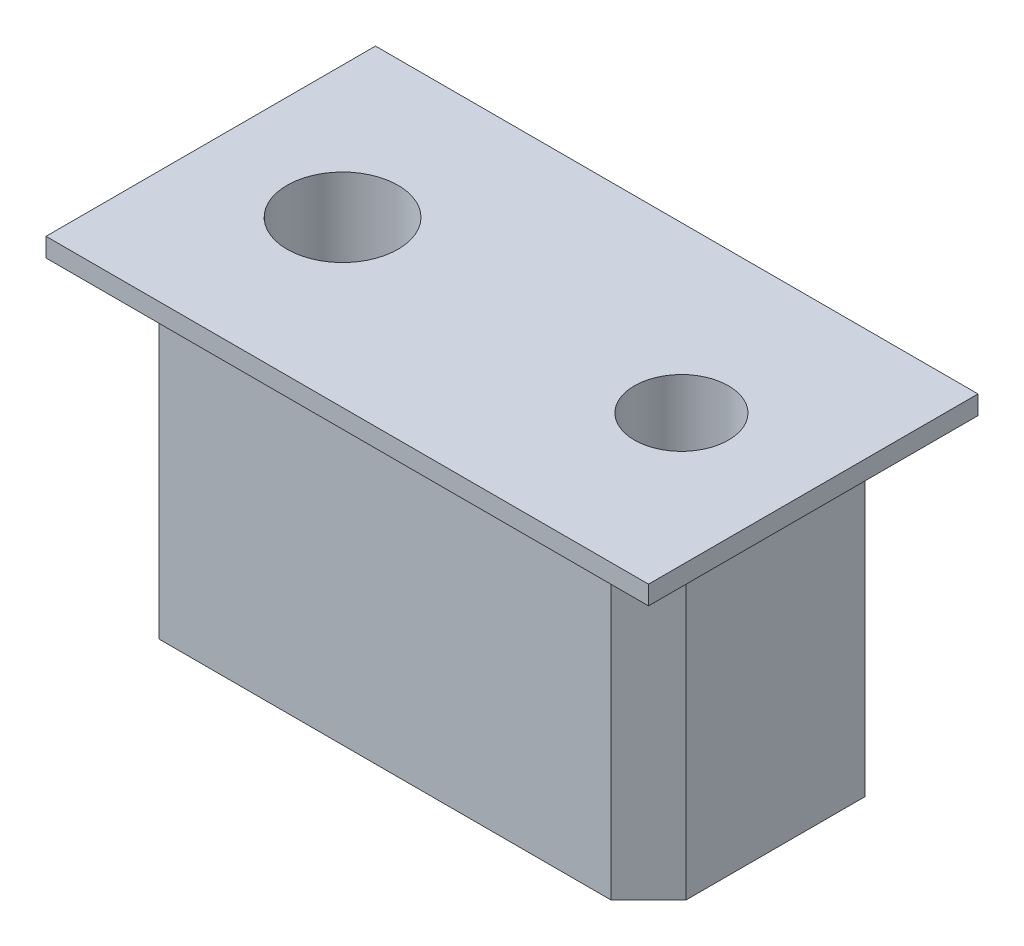
ISO-10303-21;
HEADER;
FILE_DESCRIPTION(('STEP AP214'),'2;1');
FILE_NAME('part.step','',(''),(''),'','','');
FILE_SCHEMA(('AUTOMOTIVE_DESIGN { 1 0 10303 214 1 1 1 1 }'));
ENDSEC;
DATA;
#1=APPLICATION_CONTEXT('core data for automotive mechanical design processes');
#2=APPLICATION_PROTOCOL_DEFINITION('international standard','automotive_design',2000,#1);
#3=PRODUCT_CONTEXT('',#1,'mechanical');
#4=PRODUCT('Part','Part','',(#3));
#5=PRODUCT_RELATED_PRODUCT_CATEGORY('part','',(#4));
#6=PRODUCT_DEFINITION_FORMATION('','',#4);
#7=PRODUCT_DEFINITION_CONTEXT('part definition',#1,'design');
#8=PRODUCT_DEFINITION('design','',#6,#7);
#9=PRODUCT_DEFINITION_SHAPE('','',#8);
#10=(LENGTH_UNIT() NAMED_UNIT(*) SI_UNIT(.MILLI.,.METRE.));
#11=(NAMED_UNIT(*) PLANE_ANGLE_UNIT() SI_UNIT($,.RADIAN.));
#12=(NAMED_UNIT(*) SI_UNIT($,.STERADIAN.) SOLID_ANGLE_UNIT());
#13=UNCERTAINTY_MEASURE_WITH_UNIT(LENGTH_MEASURE(1.E-05),#10,'distance_accuracy_value','');
#14=(GEOMETRIC_REPRESENTATION_CONTEXT(3) GLOBAL_UNCERTAINTY_ASSIGNED_CONTEXT((#13)) GLOBAL_UNIT_ASSIGNED_CONTEXT((#10,
#11,#12)) REPRESENTATION_CONTEXT('',''));
#15=CARTESIAN_POINT('',(0.,0.,0.));
#16=DIRECTION('',(0.,0.,1.));
#17=DIRECTION('',(1.,0.,0.));
#18=AXIS2_PLACEMENT_3D('',#15,#16,#17);
#19=CARTESIAN_POINT('',(-6.99999999999998,185.000000000001,3.37500000000002));
#20=DIRECTION('',(0.,1.,0.));
#21=DIRECTION('',(0.,0.,0.999999999999998));
#22=AXIS2_PLACEMENT_3D('',#19,#20,#21);
#23=PLANE('',#22);
#24=DIRECTION('',(0.,0.,-0.999999999999998));
#25=VECTOR('',#24,1.);
#26=CARTESIAN_POINT('',(-6.99999999999998,185.000000000001,3.37500000000002));
#27=LINE('',#26,#25);
#28=CARTESIAN_POINT('',(-6.99999999999998,185.000000000001,2.37500000000002));
#29=VERTEX_POINT('',#28);
#30=CARTESIAN_POINT('',(-6.99999999999998,185.000000000001,-2.37500000000002));
#31=VERTEX_POINT('',#30);
#32=EDGE_CURVE('E212',#29,#31,#27,.T.);
#33=ORIENTED_EDGE('',*,*,#32,.T.);
#34=DIRECTION('',(-0.707106781186548,0.,0.707106781186545));
#35=VECTOR('',#34,1.);
#36=CARTESIAN_POINT('',(-6.99999999999998,185.000000000001,-2.37500000000002));
#37=LINE('',#36,#35);
#38=CARTESIAN_POINT('',(-5.99999999999998,185.,-3.37500000000002));
#39=VERTEX_POINT('',#38);
#40=EDGE_CURVE('E233',#31,#39,#37,.F.);
#41=ORIENTED_EDGE('',*,*,#40,.T.);
#42=DIRECTION('',(1.,0.,0.));
#43=VECTOR('',#42,1.);
#44=CARTESIAN_POINT('',(-6.99999999999998,185.000000000001,-3.37500000000002));
#45=LINE('',#44,#43);
#46=CARTESIAN_POINT('',(6.00000000000002,185.,-3.37500000000002));
#47=VERTEX_POINT('',#46);
#48=EDGE_CURVE('E198',#39,#47,#45,.T.);
#49=ORIENTED_EDGE('',*,*,#48,.T.);
#50=DIRECTION('',(-0.707106781186548,0.,-0.707106781186546));
#51=VECTOR('',#50,1.);
#52=CARTESIAN_POINT('',(7.00000000000002,185.000000000001,-2.37500000000002));
#53=LINE('',#52,#51);
#54=CARTESIAN_POINT('',(7.00000000000002,185.000000000001,-2.37500000000002));
#55=VERTEX_POINT('',#54);
#56=EDGE_CURVE('E231',#47,#55,#53,.F.);
#57=ORIENTED_EDGE('',*,*,#56,.T.);
#58=DIRECTION('',(0.,0.,-0.999999999999998));
#59=VECTOR('',#58,1.);
#60=CARTESIAN_POINT('',(7.00000000000004,185.000000000001,3.37500000000002));
#61=LINE('',#60,#59);
#62=CARTESIAN_POINT('',(7.00000000000004,185.000000000001,2.37500000000002));
#63=VERTEX_POINT('',#62);
#64=EDGE_CURVE('E208',#63,#55,#61,.T.);
#65=ORIENTED_EDGE('',*,*,#64,.F.);
#66=DIRECTION('',(-0.707106781186546,0.,0.707106781186547));
#67=VECTOR('',#66,1.);
#68=CARTESIAN_POINT('',(6.00000000000002,185.,3.37500000000002));
#69=LINE('',#68,#67);
#70=CARTESIAN_POINT('',(6.00000000000002,185.,3.37500000000002));
#71=VERTEX_POINT('',#70);
#72=EDGE_CURVE('E229',#63,#71,#69,.T.);
#73=ORIENTED_EDGE('',*,*,#72,.T.);
#74=DIRECTION('',(1.,0.,0.));
#75=VECTOR('',#74,1.);
#76=CARTESIAN_POINT('',(-6.99999999999998,185.000000000001,3.37500000000002));
#77=LINE('',#76,#75);
#78=CARTESIAN_POINT('',(-5.99999999999998,185.,3.37500000000002));
#79=VERTEX_POINT('',#78);
#80=EDGE_CURVE('E201',#79,#71,#77,.T.);
#81=ORIENTED_EDGE('',*,*,#80,.F.);
#82=DIRECTION('',(-0.707106781186547,0.,-0.707106781186546));
#83=VECTOR('',#82,1.);
#84=CARTESIAN_POINT('',(-5.99999999999998,185.,3.37500000000002));
#85=LINE('',#84,#83);
#86=EDGE_CURVE('E227',#79,#29,#85,.T.);
#87=ORIENTED_EDGE('',*,*,#86,.T.);
#88=EDGE_LOOP('',(#33,#41,#49,#57,#65,#73,#81,#87));
#89=FACE_BOUND('',#88,.T.);
#90=CARTESIAN_POINT('',(-4.49999999999999,185.,0.));
#91=DIRECTION('',(0.,1.,0.));
#92=DIRECTION('',(0.,0.,0.999999999999998));
#93=AXIS2_PLACEMENT_3D('',#90,#91,#92);
#94=CIRCLE('',#93,1.4732);
#95=CARTESIAN_POINT('',(-4.49999999999999,185.,1.4732));
#96=VERTEX_POINT('',#95);
#97=EDGE_CURVE('E219',#96,#96,#94,.T.);
#98=ORIENTED_EDGE('',*,*,#97,.T.);
#99=EDGE_LOOP('',(#98));
#100=FACE_BOUND('',#99,.T.);
#101=CARTESIAN_POINT('',(4.50000000000002,185.,0.));
#102=DIRECTION('',(0.,1.,0.));
#103=DIRECTION('',(0.,0.,0.999999999999998));
#104=AXIS2_PLACEMENT_3D('',#101,#102,#103);
#105=CIRCLE('',#104,1.25);
#106=CARTESIAN_POINT('',(4.50000000000002,185.,1.25));
#107=VERTEX_POINT('',#106);
#108=EDGE_CURVE('E220',#107,#107,#105,.F.);
#109=ORIENTED_EDGE('',*,*,#108,.F.);
#110=EDGE_LOOP('',(#109));
#111=FACE_BOUND('',#110,.T.);
#112=ADVANCED_FACE('F56',(#89,#100,#111),#23,.F.);
#113=CARTESIAN_POINT('',(8.00000000000002,193.7625,-4.37500000000002));
#114=DIRECTION('',(0.,1.,0.));
#115=DIRECTION('',(0.,0.,0.999999999999998));
#116=AXIS2_PLACEMENT_3D('',#113,#114,#115);
#117=PLANE('',#116);
#118=DIRECTION('',(0.,0.,-0.999999999999998));
#119=VECTOR('',#118,1.);
#120=CARTESIAN_POINT('',(8.00000000000002,193.7625,4.37500000000002));
#121=LINE('',#120,#119);
#122=CARTESIAN_POINT('',(8.00000000000002,193.7625,4.37500000000002));
#123=VERTEX_POINT('',#122);
#124=CARTESIAN_POINT('',(8.00000000000002,193.7625,-4.37500000000002));
#125=VERTEX_POINT('',#124);
#126=EDGE_CURVE('E183',#123,#125,#121,.T.);
#127=ORIENTED_EDGE('',*,*,#126,.T.);
#128=DIRECTION('',(-1.,0.,0.));
#129=VECTOR('',#128,1.);
#130=CARTESIAN_POINT('',(8.00000000000002,193.7625,-4.37500000000002));
#131=LINE('',#130,#129);
#132=CARTESIAN_POINT('',(-8.00000000000001,193.7625,-4.37500000000002));
#133=VERTEX_POINT('',#132);
#134=EDGE_CURVE('E172',#125,#133,#131,.T.);
#135=ORIENTED_EDGE('',*,*,#134,.T.);
#136=DIRECTION('',(0.,0.,0.999999999999998));
#137=VECTOR('',#136,1.);
#138=CARTESIAN_POINT('',(-8.00000000000001,193.7625,-4.37500000000002));
#139=LINE('',#138,#137);
#140=CARTESIAN_POINT('',(-8.00000000000002,193.7625,4.37500000000002));
#141=VERTEX_POINT('',#140);
#142=EDGE_CURVE('E182',#133,#141,#139,.T.);
#143=ORIENTED_EDGE('',*,*,#142,.T.);
#144=DIRECTION('',(1.,0.,0.));
#145=VECTOR('',#144,1.);
#146=CARTESIAN_POINT('',(-8.00000000000002,193.7625,4.37500000000002));
#147=LINE('',#146,#145);
#148=EDGE_CURVE('E189',#141,#123,#147,.T.);
#149=ORIENTED_EDGE('',*,*,#148,.T.);
#150=EDGE_LOOP('',(#127,#135,#143,#149));
#151=FACE_BOUND('',#150,.T.);
#152=CARTESIAN_POINT('',(-4.49999999999999,193.7625,0.));
#153=DIRECTION('',(0.,1.,0.));
#154=DIRECTION('',(0.,0.,0.999999999999998));
#155=AXIS2_PLACEMENT_3D('',#152,#153,#154);
#156=CIRCLE('',#155,1.4732);
#157=CARTESIAN_POINT('',(-4.49999999999999,193.7625,1.4732));
#158=VERTEX_POINT('',#157);
#159=EDGE_CURVE('E216',#158,#158,#156,.T.);
#160=ORIENTED_EDGE('',*,*,#159,.F.);
#161=EDGE_LOOP('',(#160));
#162=FACE_BOUND('',#161,.T.);
#163=CARTESIAN_POINT('',(4.50000000000001,193.762500000001,0.));
#164=DIRECTION('',(0.,1.,0.));
#165=DIRECTION('',(0.,0.,0.999999999999998));
#166=AXIS2_PLACEMENT_3D('',#163,#164,#165);
#167=CIRCLE('',#166,1.25);
#168=CARTESIAN_POINT('',(4.50000000000001,193.762500000001,1.25));
#169=VERTEX_POINT('',#168);
#170=EDGE_CURVE('E221',#169,#169,#167,.F.);
#171=ORIENTED_EDGE('',*,*,#170,.T.);
#172=EDGE_LOOP('',(#171));
#173=FACE_BOUND('',#172,.T.);
#174=ADVANCED_FACE('F186',(#151,#162,#173),#117,.T.);
#175=CARTESIAN_POINT('',(-7.,193.2625,3.37500000000002));
#176=DIRECTION('',(1.,0.,0.));
#177=DIRECTION('',(0.,1.,0.));
#178=AXIS2_PLACEMENT_3D('',#175,#176,#177);
#179=PLANE('',#178);
#180=DIRECTION('',(0.,1.,0.));
#181=VECTOR('',#180,1.);
#182=CARTESIAN_POINT('',(-7.,193.2625,2.37500000000002));
#183=LINE('',#182,#181);
#184=CARTESIAN_POINT('',(-7.00000000000001,193.0125,2.37500000000002));
#185=VERTEX_POINT('',#184);
#186=EDGE_CURVE('E215',#29,#185,#183,.T.);
#187=ORIENTED_EDGE('',*,*,#186,.T.);
#188=DIRECTION('',(0.,0.,-0.999999999999998));
#189=VECTOR('',#188,1.);
#190=CARTESIAN_POINT('',(-6.99999999999999,193.012500000001,-2.37500000000002));
#191=LINE('',#190,#189);
#192=CARTESIAN_POINT('',(-6.99999999999999,193.012500000001,-2.37500000000002));
#193=VERTEX_POINT('',#192);
#194=EDGE_CURVE('E73',#185,#193,#191,.T.);
#195=ORIENTED_EDGE('',*,*,#194,.T.);
#196=DIRECTION('',(0.,-1.,0.));
#197=VECTOR('',#196,1.);
#198=CARTESIAN_POINT('',(-7.,193.2625,-2.37500000000002));
#199=LINE('',#198,#197);
#200=EDGE_CURVE('E225',#193,#31,#199,.T.);
#201=ORIENTED_EDGE('',*,*,#200,.T.);
#202=ORIENTED_EDGE('',*,*,#32,.F.);
#203=EDGE_LOOP('',(#187,#195,#201,#202));
#204=FACE_BOUND('',#203,.T.);
#205=ADVANCED_FACE('F314',(#204),#179,.F.);
#206=CARTESIAN_POINT('',(7.00000000000001,193.262500000001,3.37500000000002));
#207=DIRECTION('',(-1.,0.,0.));
#208=DIRECTION('',(0.,-1.,0.));
#209=AXIS2_PLACEMENT_3D('',#206,#207,#208);
#210=PLANE('',#209);
#211=DIRECTION('',(0.,1.,0.));
#212=VECTOR('',#211,1.);
#213=CARTESIAN_POINT('',(7.00000000000001,193.262500000001,-2.37500000000002));
#214=LINE('',#213,#212);
#215=CARTESIAN_POINT('',(7.00000000000002,193.012500000001,-2.37500000000002));
#216=VERTEX_POINT('',#215);
#217=EDGE_CURVE('E241',#55,#216,#214,.T.);
#218=ORIENTED_EDGE('',*,*,#217,.T.);
#219=DIRECTION('',(0.,0.,-0.999999999999998));
#220=VECTOR('',#219,1.);
#221=CARTESIAN_POINT('',(7.00000000000001,193.0125,2.37500000000002));
#222=LINE('',#221,#220);
#223=CARTESIAN_POINT('',(7.00000000000001,193.0125,2.37500000000002));
#224=VERTEX_POINT('',#223);
#225=EDGE_CURVE('E65',#216,#224,#222,.F.);
#226=ORIENTED_EDGE('',*,*,#225,.T.);
#227=DIRECTION('',(0.,-1.,0.));
#228=VECTOR('',#227,1.);
#229=CARTESIAN_POINT('',(7.00000000000004,185.000000000001,2.37500000000002));
#230=LINE('',#229,#228);
#231=EDGE_CURVE('E239',#224,#63,#230,.T.);
#232=ORIENTED_EDGE('',*,*,#231,.T.);
#233=ORIENTED_EDGE('',*,*,#64,.T.);
#234=EDGE_LOOP('',(#218,#226,#232,#233));
#235=FACE_BOUND('',#234,.T.);
#236=ADVANCED_FACE('F378',(#235),#210,.F.);
#237=CARTESIAN_POINT('',(-6.99999999999998,185.000000000001,3.37500000000002));
#238=DIRECTION('',(0.,0.,0.999999999999998));
#239=DIRECTION('',(1.,0.,0.));
#240=AXIS2_PLACEMENT_3D('',#237,#238,#239);
#241=PLANE('',#240);
#242=DIRECTION('',(0.,1.,0.));
#243=VECTOR('',#242,1.);
#244=CARTESIAN_POINT('',(6.00000000000002,193.2625,3.37500000000002));
#245=LINE('',#244,#243);
#246=CARTESIAN_POINT('',(6.,193.0125,3.37500000000002));
#247=VERTEX_POINT('',#246);
#248=EDGE_CURVE('E246',#71,#247,#245,.T.);
#249=ORIENTED_EDGE('',*,*,#248,.T.);
#250=DIRECTION('',(-1.,0.,0.));
#251=VECTOR('',#250,1.);
#252=CARTESIAN_POINT('',(-7.00000000000001,193.0125,3.37500000000002));
#253=LINE('',#252,#251);
#254=CARTESIAN_POINT('',(-6.,193.0125,3.37500000000002));
#255=VERTEX_POINT('',#254);
#256=EDGE_CURVE('E12',#247,#255,#253,.T.);
#257=ORIENTED_EDGE('',*,*,#256,.T.);
#258=DIRECTION('',(0.,-1.,0.));
#259=VECTOR('',#258,1.);
#260=CARTESIAN_POINT('',(-5.99999999999998,185.,3.37500000000002));
#261=LINE('',#260,#259);
#262=EDGE_CURVE('E244',#255,#79,#261,.T.);
#263=ORIENTED_EDGE('',*,*,#262,.T.);
#264=ORIENTED_EDGE('',*,*,#80,.T.);
#265=EDGE_LOOP('',(#249,#257,#263,#264));
#266=FACE_BOUND('',#265,.T.);
#267=ADVANCED_FACE('F324',(#266),#241,.T.);
#268=CARTESIAN_POINT('',(-6.99999999999998,185.000000000001,-3.37500000000002));
#269=DIRECTION('',(0.,0.,0.999999999999998));
#270=DIRECTION('',(1.,0.,0.));
#271=AXIS2_PLACEMENT_3D('',#268,#269,#270);
#272=PLANE('',#271);
#273=DIRECTION('',(0.,1.,0.));
#274=VECTOR('',#273,1.);
#275=CARTESIAN_POINT('',(-5.99999999999998,185.,-3.37500000000002));
#276=LINE('',#275,#274);
#277=CARTESIAN_POINT('',(-6.,193.0125,-3.37500000000002));
#278=VERTEX_POINT('',#277);
#279=EDGE_CURVE('E237',#39,#278,#276,.T.);
#280=ORIENTED_EDGE('',*,*,#279,.T.);
#281=DIRECTION('',(-1.,0.,0.));
#282=VECTOR('',#281,1.);
#283=CARTESIAN_POINT('',(6.00000000000001,193.0125,-3.37500000000002));
#284=LINE('',#283,#282);
#285=CARTESIAN_POINT('',(6.00000000000001,193.0125,-3.37500000000002));
#286=VERTEX_POINT('',#285);
#287=EDGE_CURVE('E274',#278,#286,#284,.F.);
#288=ORIENTED_EDGE('',*,*,#287,.T.);
#289=DIRECTION('',(0.,-1.,0.));
#290=VECTOR('',#289,1.);
#291=CARTESIAN_POINT('',(6.00000000000002,185.,-3.37500000000002));
#292=LINE('',#291,#290);
#293=EDGE_CURVE('E235',#286,#47,#292,.T.);
#294=ORIENTED_EDGE('',*,*,#293,.T.);
#295=ORIENTED_EDGE('',*,*,#48,.F.);
#296=EDGE_LOOP('',(#280,#288,#294,#295));
#297=FACE_BOUND('',#296,.T.);
#298=ADVANCED_FACE('F355',(#297),#272,.F.);
#299=CARTESIAN_POINT('',(8.00000000000002,193.7625,4.37500000000002));
#300=DIRECTION('',(-1.,0.,0.));
#301=DIRECTION('',(0.,0.,0.999999999999998));
#302=AXIS2_PLACEMENT_3D('',#299,#300,#301);
#303=PLANE('',#302);
#304=DIRECTION('',(0.,0.,-0.999999999999998));
#305=VECTOR('',#304,1.);
#306=CARTESIAN_POINT('',(8.00000000000001,193.2625,4.37500000000002));
#307=LINE('',#306,#305);
#308=CARTESIAN_POINT('',(8.00000000000001,193.2625,4.37500000000002));
#309=VERTEX_POINT('',#308);
#310=CARTESIAN_POINT('',(8.00000000000002,193.2625,-4.37500000000002));
#311=VERTEX_POINT('',#310);
#312=EDGE_CURVE('E197',#309,#311,#307,.T.);
#313=ORIENTED_EDGE('',*,*,#312,.T.);
#314=DIRECTION('',(0.,-1.,0.));
#315=VECTOR('',#314,1.);
#316=CARTESIAN_POINT('',(8.00000000000002,193.7625,-4.37500000000002));
#317=LINE('',#316,#315);
#318=EDGE_CURVE('E176',#125,#311,#317,.T.);
#319=ORIENTED_EDGE('',*,*,#318,.F.);
#320=ORIENTED_EDGE('',*,*,#126,.F.);
#321=DIRECTION('',(0.,-1.,0.));
#322=VECTOR('',#321,1.);
#323=CARTESIAN_POINT('',(8.00000000000002,193.7625,4.37500000000002));
#324=LINE('',#323,#322);
#325=EDGE_CURVE('E577',#123,#309,#324,.T.);
#326=ORIENTED_EDGE('',*,*,#325,.T.);
#327=EDGE_LOOP('',(#313,#319,#320,#326));
#328=FACE_BOUND('',#327,.T.);
#329=ADVANCED_FACE('F195',(#328),#303,.F.);
#330=CARTESIAN_POINT('',(8.00000000000002,193.7625,-4.37500000000002));
#331=DIRECTION('',(0.,0.,0.999999999999998));
#332=DIRECTION('',(1.,0.,0.));
#333=AXIS2_PLACEMENT_3D('',#330,#331,#332);
#334=PLANE('',#333);
#335=DIRECTION('',(-1.,0.,0.));
#336=VECTOR('',#335,1.);
#337=CARTESIAN_POINT('',(8.00000000000002,193.2625,-4.37500000000002));
#338=LINE('',#337,#336);
#339=CARTESIAN_POINT('',(-7.99999999999999,193.2625,-4.37500000000002));
#340=VERTEX_POINT('',#339);
#341=EDGE_CURVE('E575',#311,#340,#338,.T.);
#342=ORIENTED_EDGE('',*,*,#341,.T.);
#343=DIRECTION('',(0.,-1.,0.));
#344=VECTOR('',#343,1.);
#345=CARTESIAN_POINT('',(-8.00000000000001,193.7625,-4.37500000000002));
#346=LINE('',#345,#344);
#347=EDGE_CURVE('E179',#133,#340,#346,.T.);
#348=ORIENTED_EDGE('',*,*,#347,.F.);
#349=ORIENTED_EDGE('',*,*,#134,.F.);
#350=ORIENTED_EDGE('',*,*,#318,.T.);
#351=EDGE_LOOP('',(#342,#348,#349,#350));
#352=FACE_BOUND('',#351,.T.);
#353=ADVANCED_FACE('F174',(#352),#334,.F.);
#354=CARTESIAN_POINT('',(-8.00000000000001,193.7625,-4.37500000000002));
#355=DIRECTION('',(1.,0.,0.));
#356=DIRECTION('',(0.,0.,-0.999999999999998));
#357=AXIS2_PLACEMENT_3D('',#354,#355,#356);
#358=PLANE('',#357);
#359=DIRECTION('',(0.,0.,0.999999999999998));
#360=VECTOR('',#359,1.);
#361=CARTESIAN_POINT('',(-7.99999999999999,193.2625,-4.37500000000002));
#362=LINE('',#361,#360);
#363=CARTESIAN_POINT('',(-7.99999999999999,193.2625,4.37500000000002));
#364=VERTEX_POINT('',#363);
#365=EDGE_CURVE('E572',#340,#364,#362,.T.);
#366=ORIENTED_EDGE('',*,*,#365,.T.);
#367=DIRECTION('',(0.,-1.,0.));
#368=VECTOR('',#367,1.);
#369=CARTESIAN_POINT('',(-8.00000000000002,193.7625,4.37500000000002));
#370=LINE('',#369,#368);
#371=EDGE_CURVE('E203',#141,#364,#370,.T.);
#372=ORIENTED_EDGE('',*,*,#371,.F.);
#373=ORIENTED_EDGE('',*,*,#142,.F.);
#374=ORIENTED_EDGE('',*,*,#347,.T.);
#375=EDGE_LOOP('',(#366,#372,#373,#374));
#376=FACE_BOUND('',#375,.T.);
#377=ADVANCED_FACE('F506',(#376),#358,.F.);
#378=CARTESIAN_POINT('',(-8.00000000000002,193.7625,4.37500000000002));
#379=DIRECTION('',(0.,0.,-0.999999999999998));
#380=DIRECTION('',(-1.,0.,0.));
#381=AXIS2_PLACEMENT_3D('',#378,#379,#380);
#382=PLANE('',#381);
#383=DIRECTION('',(1.,0.,0.));
#384=VECTOR('',#383,1.);
#385=CARTESIAN_POINT('',(-7.99999999999999,193.2625,4.37500000000002));
#386=LINE('',#385,#384);
#387=EDGE_CURVE('E193',#364,#309,#386,.T.);
#388=ORIENTED_EDGE('',*,*,#387,.T.);
#389=ORIENTED_EDGE('',*,*,#325,.F.);
#390=ORIENTED_EDGE('',*,*,#148,.F.);
#391=ORIENTED_EDGE('',*,*,#371,.T.);
#392=EDGE_LOOP('',(#388,#389,#390,#391));
#393=FACE_BOUND('',#392,.T.);
#394=ADVANCED_FACE('F498',(#393),#382,.F.);
#395=CARTESIAN_POINT('',(8.00000000000002,193.2625,-4.37500000000002));
#396=DIRECTION('',(0.,1.,0.));
#397=DIRECTION('',(0.,0.,0.999999999999998));
#398=AXIS2_PLACEMENT_3D('',#395,#396,#397);
#399=PLANE('',#398);
#400=DIRECTION('',(0.707106781186548,0.,0.707106781186546));
#401=VECTOR('',#400,1.);
#402=CARTESIAN_POINT('',(6.67677669529665,193.2625,-3.05177669529666));
#403=LINE('',#402,#401);
#404=CARTESIAN_POINT('',(7.24999999999999,193.2625,-2.47855339059327));
#405=VERTEX_POINT('',#404);
#406=CARTESIAN_POINT('',(6.10355339059327,193.262500000001,-3.62499999999999));
#407=VERTEX_POINT('',#406);
#408=EDGE_CURVE('E261',#405,#407,#403,.F.);
#409=ORIENTED_EDGE('',*,*,#408,.T.);
#410=DIRECTION('',(-1.,0.,0.));
#411=VECTOR('',#410,1.);
#412=CARTESIAN_POINT('',(-5.99999999999999,193.2625,-3.62499999999999));
#413=LINE('',#412,#411);
#414=CARTESIAN_POINT('',(-6.10355339059325,193.262500000001,-3.62499999999999));
#415=VERTEX_POINT('',#414);
#416=EDGE_CURVE('E264',#407,#415,#413,.T.);
#417=ORIENTED_EDGE('',*,*,#416,.T.);
#418=DIRECTION('',(0.707106781186548,0.,-0.707106781186545));
#419=VECTOR('',#418,1.);
#420=CARTESIAN_POINT('',(1.3232233047034,193.262500000001,-11.0517766952966));
#421=LINE('',#420,#419);
#422=CARTESIAN_POINT('',(-7.24999999999996,193.262500000001,-2.47855339059327));
#423=VERTEX_POINT('',#422);
#424=EDGE_CURVE('E259',#415,#423,#421,.F.);
#425=ORIENTED_EDGE('',*,*,#424,.T.);
#426=DIRECTION('',(0.,0.,-0.999999999999998));
#427=VECTOR('',#426,1.);
#428=CARTESIAN_POINT('',(-7.24999999999997,193.262500000001,2.37500000000002));
#429=LINE('',#428,#427);
#430=CARTESIAN_POINT('',(-7.24999999999997,193.262500000001,2.47855339059327));
#431=VERTEX_POINT('',#430);
#432=EDGE_CURVE('E257',#423,#431,#429,.F.);
#433=ORIENTED_EDGE('',*,*,#432,.T.);
#434=DIRECTION('',(0.707106781186547,0.,0.707106781186546));
#435=VECTOR('',#434,1.);
#436=CARTESIAN_POINT('',(-3.05177669529664,193.2625,6.67677669529665));
#437=LINE('',#436,#435);
#438=CARTESIAN_POINT('',(-6.10355339059325,193.262500000001,3.62499999999999));
#439=VERTEX_POINT('',#438);
#440=EDGE_CURVE('E251',#431,#439,#437,.T.);
#441=ORIENTED_EDGE('',*,*,#440,.T.);
#442=DIRECTION('',(-1.,0.,0.));
#443=VECTOR('',#442,1.);
#444=CARTESIAN_POINT('',(8.00000000000002,193.2625,3.62499999999999));
#445=LINE('',#444,#443);
#446=CARTESIAN_POINT('',(6.10355339059327,193.262500000001,3.62499999999999));
#447=VERTEX_POINT('',#446);
#448=EDGE_CURVE('E249',#439,#447,#445,.F.);
#449=ORIENTED_EDGE('',*,*,#448,.T.);
#450=DIRECTION('',(0.707106781186546,0.,-0.707106781186547));
#451=VECTOR('',#450,1.);
#452=CARTESIAN_POINT('',(11.0517766952966,193.2625,-1.32322330470336));
#453=LINE('',#452,#451);
#454=CARTESIAN_POINT('',(7.24999999999999,193.2625,2.47855339059327));
#455=VERTEX_POINT('',#454);
#456=EDGE_CURVE('E253',#447,#455,#453,.T.);
#457=ORIENTED_EDGE('',*,*,#456,.T.);
#458=DIRECTION('',(0.,0.,-0.999999999999998));
#459=VECTOR('',#458,1.);
#460=CARTESIAN_POINT('',(7.24999999999999,193.2625,-2.37500000000002));
#461=LINE('',#460,#459);
#462=EDGE_CURVE('E255',#455,#405,#461,.T.);
#463=ORIENTED_EDGE('',*,*,#462,.T.);
#464=EDGE_LOOP('',(#409,#417,#425,#433,#441,#449,#457,#463));
#465=FACE_BOUND('',#464,.T.);
#466=ORIENTED_EDGE('',*,*,#312,.F.);
#467=ORIENTED_EDGE('',*,*,#387,.F.);
#468=ORIENTED_EDGE('',*,*,#365,.F.);
#469=ORIENTED_EDGE('',*,*,#341,.F.);
#470=EDGE_LOOP('',(#466,#467,#468,#469));
#471=FACE_BOUND('',#470,.T.);
#472=ADVANCED_FACE('F340',(#465,#471),#399,.F.);
#473=CARTESIAN_POINT('',(-4.49999999999999,202.803113019111,0.));
#474=DIRECTION('',(0.,1.,0.));
#475=DIRECTION('',(0.,0.,0.999999999999998));
#476=AXIS2_PLACEMENT_3D('',#473,#474,#475);
#477=CYLINDRICAL_SURFACE('',#476,1.4732);
#478=ORIENTED_EDGE('',*,*,#159,.T.);
#479=EDGE_LOOP('',(#478));
#480=FACE_BOUND('',#479,.T.);
#481=ORIENTED_EDGE('',*,*,#97,.F.);
#482=EDGE_LOOP('',(#481));
#483=FACE_BOUND('',#482,.T.);
#484=ADVANCED_FACE('F471',(#480,#483),#477,.F.);
#485=CARTESIAN_POINT('',(4.50000000000002,219.4968549387,0.));
#486=DIRECTION('',(0.,1.,0.));
#487=DIRECTION('',(-1.,0.,0.));
#488=AXIS2_PLACEMENT_3D('',#485,#486,#487);
#489=CYLINDRICAL_SURFACE('',#488,1.25);
#490=ORIENTED_EDGE('',*,*,#170,.F.);
#491=EDGE_LOOP('',(#490));
#492=FACE_BOUND('',#491,.T.);
#493=ORIENTED_EDGE('',*,*,#108,.T.);
#494=EDGE_LOOP('',(#493));
#495=FACE_BOUND('',#494,.T.);
#496=ADVANCED_FACE('F385',(#492,#495),#489,.F.);
#497=CARTESIAN_POINT('',(-7.,193.2625,-2.37500000000002));
#498=DIRECTION('',(0.707106781186547,0.,0.707106781186546));
#499=DIRECTION('',(0.707106781186548,0.,-0.707106781186545));
#500=AXIS2_PLACEMENT_3D('',#497,#498,#499);
#501=PLANE('',#500);
#502=ORIENTED_EDGE('',*,*,#200,.F.);
#503=DIRECTION('',(-0.707106781186548,0.,0.707106781186545));
#504=VECTOR('',#503,1.);
#505=CARTESIAN_POINT('',(-6.99999999999999,193.012500000001,-2.37500000000002));
#506=LINE('',#505,#504);
#507=EDGE_CURVE('E80',#193,#278,#506,.F.);
#508=ORIENTED_EDGE('',*,*,#507,.T.);
#509=ORIENTED_EDGE('',*,*,#279,.F.);
#510=ORIENTED_EDGE('',*,*,#40,.F.);
#511=EDGE_LOOP('',(#502,#508,#509,#510));
#512=FACE_BOUND('',#511,.T.);
#513=ADVANCED_FACE('F382',(#512),#501,.F.);
#514=CARTESIAN_POINT('',(7.00000000000001,193.262500000001,-2.37500000000002));
#515=DIRECTION('',(-0.707106781186548,0.,0.707106781186545));
#516=DIRECTION('',(0.707106781186548,0.,0.707106781186546));
#517=AXIS2_PLACEMENT_3D('',#514,#515,#516);
#518=PLANE('',#517);
#519=ORIENTED_EDGE('',*,*,#293,.F.);
#520=DIRECTION('',(-0.707106781186548,0.,-0.707106781186546));
#521=VECTOR('',#520,1.);
#522=CARTESIAN_POINT('',(7.00000000000002,193.012500000001,-2.37500000000002));
#523=LINE('',#522,#521);
#524=EDGE_CURVE('E266',#286,#216,#523,.F.);
#525=ORIENTED_EDGE('',*,*,#524,.T.);
#526=ORIENTED_EDGE('',*,*,#217,.F.);
#527=ORIENTED_EDGE('',*,*,#56,.F.);
#528=EDGE_LOOP('',(#519,#525,#526,#527));
#529=FACE_BOUND('',#528,.T.);
#530=ADVANCED_FACE('F359',(#529),#518,.F.);
#531=CARTESIAN_POINT('',(6.00000000000002,185.,3.37500000000002));
#532=DIRECTION('',(0.707106781186549,0.,0.707106781186544));
#533=DIRECTION('',(0.707106781186546,0.,-0.707106781186547));
#534=AXIS2_PLACEMENT_3D('',#531,#532,#533);
#535=PLANE('',#534);
#536=ORIENTED_EDGE('',*,*,#231,.F.);
#537=DIRECTION('',(0.707106781186546,0.,-0.707106781186547));
#538=VECTOR('',#537,1.);
#539=CARTESIAN_POINT('',(6.,193.0125,3.37500000000002));
#540=LINE('',#539,#538);
#541=EDGE_CURVE('E269',#224,#247,#540,.F.);
#542=ORIENTED_EDGE('',*,*,#541,.T.);
#543=ORIENTED_EDGE('',*,*,#248,.F.);
#544=ORIENTED_EDGE('',*,*,#72,.F.);
#545=EDGE_LOOP('',(#536,#542,#543,#544));
#546=FACE_BOUND('',#545,.T.);
#547=ADVANCED_FACE('F327',(#546),#535,.T.);
#548=CARTESIAN_POINT('',(-5.99999999999998,185.,3.37500000000002));
#549=DIRECTION('',(-0.707106781186549,0.,0.707106781186545));
#550=DIRECTION('',(0.707106781186547,0.,0.707106781186546));
#551=AXIS2_PLACEMENT_3D('',#548,#549,#550);
#552=PLANE('',#551);
#553=ORIENTED_EDGE('',*,*,#262,.F.);
#554=DIRECTION('',(0.707106781186547,0.,0.707106781186546));
#555=VECTOR('',#554,1.);
#556=CARTESIAN_POINT('',(-6.,193.0125,3.37500000000002));
#557=LINE('',#556,#555);
#558=EDGE_CURVE('E271',#255,#185,#557,.F.);
#559=ORIENTED_EDGE('',*,*,#558,.T.);
#560=ORIENTED_EDGE('',*,*,#186,.F.);
#561=ORIENTED_EDGE('',*,*,#86,.F.);
#562=EDGE_LOOP('',(#553,#559,#560,#561));
#563=FACE_BOUND('',#562,.T.);
#564=ADVANCED_FACE('F311',(#563),#552,.T.);
#565=CARTESIAN_POINT('',(-3.05177669529664,193.0125,6.67677669529665));
#566=DIRECTION('',(0.707106781186547,0.,0.707106781186546));
#567=DIRECTION('',(0.707106781186549,0.,-0.707106781186545));
#568=AXIS2_PLACEMENT_3D('',#565,#566,#567);
#569=CYLINDRICAL_SURFACE('',#568,0.25);
#570=CARTESIAN_POINT('',(-7.24999999999999,193.012500000001,2.47855339059327));
#571=DIRECTION('',(0.38268343236509,0.,0.923879532511285));
#572=DIRECTION('',(-0.923879532511288,0.,0.382683432365088));
#573=AXIS2_PLACEMENT_3D('',#570,#571,#572);
#574=ELLIPSE('',#573,0.270598050073098,0.25);
#575=EDGE_CURVE('E293',#185,#431,#574,.T.);
#576=ORIENTED_EDGE('',*,*,#575,.F.);
#577=ORIENTED_EDGE('',*,*,#558,.F.);
#578=CARTESIAN_POINT('',(-6.10355339059326,193.012500000001,3.62499999999999));
#579=DIRECTION('',(-0.923879532511287,0.,-0.382683432365089));
#580=DIRECTION('',(-0.382683432365091,0.,0.923879532511285));
#581=AXIS2_PLACEMENT_3D('',#578,#579,#580);
#582=ELLIPSE('',#581,0.270598050073099,0.25);
#583=EDGE_CURVE('E60',#439,#255,#582,.T.);
#584=ORIENTED_EDGE('',*,*,#583,.F.);
#585=ORIENTED_EDGE('',*,*,#440,.F.);
#586=EDGE_LOOP('',(#576,#577,#584,#585));
#587=FACE_BOUND('',#586,.T.);
#588=ADVANCED_FACE('F58',(#587),#569,.F.);
#589=CARTESIAN_POINT('',(-7.00000000000001,193.0125,3.62499999999999));
#590=DIRECTION('',(-1.,0.,0.));
#591=DIRECTION('',(0.,0.,0.999999999999998));
#592=AXIS2_PLACEMENT_3D('',#589,#590,#591);
#593=CYLINDRICAL_SURFACE('',#592,0.25);
#594=ORIENTED_EDGE('',*,*,#583,.T.);
#595=ORIENTED_EDGE('',*,*,#256,.F.);
#596=CARTESIAN_POINT('',(6.10355339059327,193.0125,3.62499999999999));
#597=DIRECTION('',(-0.923879532511287,0.,0.38268343236509));
#598=DIRECTION('',(-0.382683432365091,0.,-0.923879532511285));
#599=AXIS2_PLACEMENT_3D('',#596,#597,#598);
#600=ELLIPSE('',#599,0.270598050073099,0.25);
#601=EDGE_CURVE('E291',#447,#247,#600,.T.);
#602=ORIENTED_EDGE('',*,*,#601,.F.);
#603=ORIENTED_EDGE('',*,*,#448,.F.);
#604=EDGE_LOOP('',(#594,#595,#602,#603));
#605=FACE_BOUND('',#604,.T.);
#606=ADVANCED_FACE('F303',(#605),#593,.F.);
#607=CARTESIAN_POINT('',(-7.24999999999999,193.012500000001,3.37500000000002));
#608=DIRECTION('',(0.,0.,0.999999999999998));
#609=DIRECTION('',(1.,0.,0.));
#610=AXIS2_PLACEMENT_3D('',#607,#608,#609);
#611=CYLINDRICAL_SURFACE('',#610,0.25);
#612=ORIENTED_EDGE('',*,*,#575,.T.);
#613=ORIENTED_EDGE('',*,*,#432,.F.);
#614=CARTESIAN_POINT('',(-7.24999999999999,193.012500000001,-2.47855339059327));
#615=DIRECTION('',(-0.38268343236509,0.,0.923879532511285));
#616=DIRECTION('',(0.923879532511287,0.,0.382683432365089));
#617=AXIS2_PLACEMENT_3D('',#614,#615,#616);
#618=ELLIPSE('',#617,0.270598050073099,0.25);
#619=EDGE_CURVE('E288',#193,#423,#618,.T.);
#620=ORIENTED_EDGE('',*,*,#619,.F.);
#621=ORIENTED_EDGE('',*,*,#194,.F.);
#622=EDGE_LOOP('',(#612,#613,#620,#621));
#623=FACE_BOUND('',#622,.T.);
#624=ADVANCED_FACE('F344',(#623),#611,.F.);
#625=CARTESIAN_POINT('',(11.0517766952966,193.0125,-1.32322330470336));
#626=DIRECTION('',(0.707106781186546,0.,-0.707106781186547));
#627=DIRECTION('',(-0.707106781186549,0.,-0.707106781186544));
#628=AXIS2_PLACEMENT_3D('',#625,#626,#627);
#629=CYLINDRICAL_SURFACE('',#628,0.25);
#630=ORIENTED_EDGE('',*,*,#601,.T.);
#631=ORIENTED_EDGE('',*,*,#541,.F.);
#632=CARTESIAN_POINT('',(7.25,193.0125,2.47855339059327));
#633=DIRECTION('',(-0.382683432365089,0.,0.923879532511285));
#634=DIRECTION('',(0.923879532511288,0.,0.382683432365088));
#635=AXIS2_PLACEMENT_3D('',#632,#633,#634);
#636=ELLIPSE('',#635,0.270598050073098,0.25);
#637=EDGE_CURVE('E285',#455,#224,#636,.T.);
#638=ORIENTED_EDGE('',*,*,#637,.F.);
#639=ORIENTED_EDGE('',*,*,#456,.F.);
#640=EDGE_LOOP('',(#630,#631,#638,#639));
#641=FACE_BOUND('',#640,.T.);
#642=ADVANCED_FACE('F331',(#641),#629,.F.);
#643=CARTESIAN_POINT('',(1.32322330470339,193.012500000001,-11.0517766952966));
#644=DIRECTION('',(0.707106781186548,0.,-0.707106781186545));
#645=DIRECTION('',(-0.707106781186547,0.,-0.707106781186546));
#646=AXIS2_PLACEMENT_3D('',#643,#644,#645);
#647=CYLINDRICAL_SURFACE('',#646,0.25);
#648=ORIENTED_EDGE('',*,*,#619,.T.);
#649=ORIENTED_EDGE('',*,*,#424,.F.);
#650=CARTESIAN_POINT('',(-6.10355339059325,193.012500000001,-3.62499999999999));
#651=DIRECTION('',(0.923879532511288,0.,-0.382683432365089));
#652=DIRECTION('',(0.38268343236509,0.,0.923879532511285));
#653=AXIS2_PLACEMENT_3D('',#650,#651,#652);
#654=ELLIPSE('',#653,0.270598050073099,0.25);
#655=EDGE_CURVE('E282',#278,#415,#654,.F.);
#656=ORIENTED_EDGE('',*,*,#655,.F.);
#657=ORIENTED_EDGE('',*,*,#507,.F.);
#658=EDGE_LOOP('',(#648,#649,#656,#657));
#659=FACE_BOUND('',#658,.T.);
#660=ADVANCED_FACE('F346',(#659),#647,.F.);
#661=CARTESIAN_POINT('',(7.25,193.0125,-4.37500000000002));
#662=DIRECTION('',(0.,0.,0.999999999999998));
#663=DIRECTION('',(1.,0.,0.));
#664=AXIS2_PLACEMENT_3D('',#661,#662,#663);
#665=CYLINDRICAL_SURFACE('',#664,0.25);
#666=ORIENTED_EDGE('',*,*,#637,.T.);
#667=ORIENTED_EDGE('',*,*,#225,.F.);
#668=CARTESIAN_POINT('',(7.25,193.0125,-2.47855339059327));
#669=DIRECTION('',(0.38268343236509,0.,0.923879532511285));
#670=DIRECTION('',(-0.923879532511288,0.,0.382683432365089));
#671=AXIS2_PLACEMENT_3D('',#668,#669,#670);
#672=ELLIPSE('',#671,0.270598050073099,0.25);
#673=EDGE_CURVE('E280',#405,#216,#672,.T.);
#674=ORIENTED_EDGE('',*,*,#673,.F.);
#675=ORIENTED_EDGE('',*,*,#462,.F.);
#676=EDGE_LOOP('',(#666,#667,#674,#675));
#677=FACE_BOUND('',#676,.T.);
#678=ADVANCED_FACE('F336',(#677),#665,.F.);
#679=CARTESIAN_POINT('',(8.00000000000001,193.0125,-3.62499999999999));
#680=DIRECTION('',(1.,0.,0.));
#681=DIRECTION('',(0.,0.,-0.999999999999998));
#682=AXIS2_PLACEMENT_3D('',#679,#680,#681);
#683=CYLINDRICAL_SURFACE('',#682,0.25);
#684=ORIENTED_EDGE('',*,*,#655,.T.);
#685=ORIENTED_EDGE('',*,*,#416,.F.);
#686=CARTESIAN_POINT('',(6.10355339059327,193.0125,-3.62499999999999));
#687=DIRECTION('',(0.923879532511287,0.,0.382683432365089));
#688=DIRECTION('',(0.38268343236509,0.,-0.923879532511285));
#689=AXIS2_PLACEMENT_3D('',#686,#687,#688);
#690=ELLIPSE('',#689,0.270598050073099,0.25);
#691=EDGE_CURVE('E278',#286,#407,#690,.F.);
#692=ORIENTED_EDGE('',*,*,#691,.F.);
#693=ORIENTED_EDGE('',*,*,#287,.F.);
#694=EDGE_LOOP('',(#684,#685,#692,#693));
#695=FACE_BOUND('',#694,.T.);
#696=ADVANCED_FACE('F352',(#695),#683,.F.);
#697=CARTESIAN_POINT('',(6.67677669529665,193.0125,-3.05177669529666));
#698=DIRECTION('',(0.707106781186548,0.,0.707106781186546));
#699=DIRECTION('',(0.707106781186548,0.,-0.707106781186546));
#700=AXIS2_PLACEMENT_3D('',#697,#698,#699);
#701=CYLINDRICAL_SURFACE('',#700,0.25);
#702=ORIENTED_EDGE('',*,*,#673,.T.);
#703=ORIENTED_EDGE('',*,*,#524,.F.);
#704=ORIENTED_EDGE('',*,*,#691,.T.);
#705=ORIENTED_EDGE('',*,*,#408,.F.);
#706=EDGE_LOOP('',(#702,#703,#704,#705));
#707=FACE_BOUND('',#706,.T.);
#708=ADVANCED_FACE('F362',(#707),#701,.F.);
#709=CLOSED_SHELL('',(#112,#174,#205,#236,#267,#298,#329,#353,#377,#394,#472,#484,#496,#513,
#530,#547,#564,#588,#606,#624,#642,#660,#678,#696,#708));
#710=MANIFOLD_SOLID_BREP('B2',#709);
#711=ADVANCED_BREP_SHAPE_REPRESENTATION('',(#18,#710),#14);
#712=SHAPE_DEFINITION_REPRESENTATION(#9,#711);
ENDSEC;
END-ISO-10303-21;
